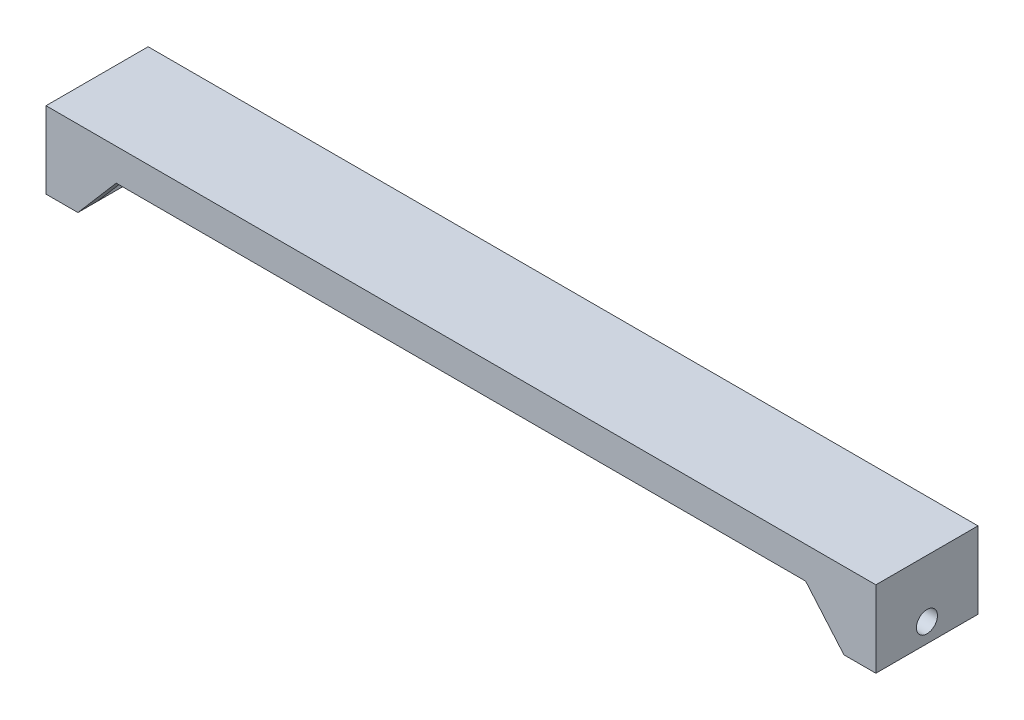
ISO-10303-21;
HEADER;
FILE_DESCRIPTION(('STEP AP214'),'2;1');
FILE_NAME('part.step','',(''),(''),'','','');
FILE_SCHEMA(('AUTOMOTIVE_DESIGN { 1 0 10303 214 1 1 1 1 }'));
ENDSEC;
DATA;
#1=APPLICATION_CONTEXT('core data for automotive mechanical design processes');
#2=APPLICATION_PROTOCOL_DEFINITION('international standard','automotive_design',2000,#1);
#3=PRODUCT_CONTEXT('',#1,'mechanical');
#4=PRODUCT('Part','Part','',(#3));
#5=PRODUCT_RELATED_PRODUCT_CATEGORY('part','',(#4));
#6=PRODUCT_DEFINITION_FORMATION('','',#4);
#7=PRODUCT_DEFINITION_CONTEXT('part definition',#1,'design');
#8=PRODUCT_DEFINITION('design','',#6,#7);
#9=PRODUCT_DEFINITION_SHAPE('','',#8);
#10=(LENGTH_UNIT() NAMED_UNIT(*) SI_UNIT(.MILLI.,.METRE.));
#11=(NAMED_UNIT(*) PLANE_ANGLE_UNIT() SI_UNIT($,.RADIAN.));
#12=(NAMED_UNIT(*) SI_UNIT($,.STERADIAN.) SOLID_ANGLE_UNIT());
#13=UNCERTAINTY_MEASURE_WITH_UNIT(LENGTH_MEASURE(1.E-05),#10,'distance_accuracy_value','');
#14=(GEOMETRIC_REPRESENTATION_CONTEXT(3) GLOBAL_UNCERTAINTY_ASSIGNED_CONTEXT((#13)) GLOBAL_UNIT_ASSIGNED_CONTEXT((#10,
#11,#12)) REPRESENTATION_CONTEXT('',''));
#15=CARTESIAN_POINT('',(0.,0.,0.));
#16=DIRECTION('',(0.,0.,1.));
#17=DIRECTION('',(1.,0.,0.));
#18=AXIS2_PLACEMENT_3D('',#15,#16,#17);
#19=CARTESIAN_POINT('',(60.,-5.00000000000001,16.));
#20=DIRECTION('',(0.,1.,0.));
#21=DIRECTION('',(0.,0.,1.));
#22=AXIS2_PLACEMENT_3D('',#19,#20,#21);
#23=PLANE('',#22);
#24=DIRECTION('',(-1.,0.,0.));
#25=VECTOR('',#24,1.);
#26=CARTESIAN_POINT('',(54.,-5.00000000000001,13.));
#27=LINE('',#26,#25);
#28=CARTESIAN_POINT('',(60.,-5.00000000000001,13.));
#29=VERTEX_POINT('',#28);
#30=CARTESIAN_POINT('',(54.,-5.00000000000001,13.));
#31=VERTEX_POINT('',#30);
#32=EDGE_CURVE('E154',#29,#31,#27,.T.);
#33=ORIENTED_EDGE('',*,*,#32,.T.);
#34=DIRECTION('',(0.,0.,1.));
#35=VECTOR('',#34,1.);
#36=CARTESIAN_POINT('',(54.,-5.00000000000001,13.));
#37=LINE('',#36,#35);
#38=CARTESIAN_POINT('',(54.,-5.00000000000001,16.));
#39=VERTEX_POINT('',#38);
#40=EDGE_CURVE('E139',#31,#39,#37,.T.);
#41=ORIENTED_EDGE('',*,*,#40,.T.);
#42=DIRECTION('',(1.,0.,0.));
#43=VECTOR('',#42,1.);
#44=CARTESIAN_POINT('',(60.,-5.00000000000001,16.));
#45=LINE('',#44,#43);
#46=CARTESIAN_POINT('',(-54.,-5.00000000000001,16.));
#47=VERTEX_POINT('',#46);
#48=EDGE_CURVE('E224',#47,#39,#45,.T.);
#49=ORIENTED_EDGE('',*,*,#48,.F.);
#50=DIRECTION('',(0.,0.,1.));
#51=VECTOR('',#50,1.);
#52=CARTESIAN_POINT('',(-54.,-5.00000000000001,13.));
#53=LINE('',#52,#51);
#54=CARTESIAN_POINT('',(-54.,-5.00000000000001,13.));
#55=VERTEX_POINT('',#54);
#56=EDGE_CURVE('E184',#55,#47,#53,.T.);
#57=ORIENTED_EDGE('',*,*,#56,.F.);
#58=DIRECTION('',(1.,0.,0.));
#59=VECTOR('',#58,1.);
#60=CARTESIAN_POINT('',(-54.,-5.00000000000001,13.));
#61=LINE('',#60,#59);
#62=CARTESIAN_POINT('',(-60.,-5.00000000000001,13.));
#63=VERTEX_POINT('',#62);
#64=EDGE_CURVE('E177',#63,#55,#61,.T.);
#65=ORIENTED_EDGE('',*,*,#64,.F.);
#66=DIRECTION('',(0.,0.,-1.));
#67=VECTOR('',#66,1.);
#68=CARTESIAN_POINT('',(-60.,-5.00000000000001,16.));
#69=LINE('',#68,#67);
#70=CARTESIAN_POINT('',(-60.,-5.00000000000001,3.));
#71=VERTEX_POINT('',#70);
#72=EDGE_CURVE('E257',#63,#71,#69,.T.);
#73=ORIENTED_EDGE('',*,*,#72,.T.);
#74=DIRECTION('',(1.,0.,0.));
#75=VECTOR('',#74,1.);
#76=CARTESIAN_POINT('',(-54.,-5.00000000000001,3.));
#77=LINE('',#76,#75);
#78=CARTESIAN_POINT('',(-54.,-5.00000000000001,3.));
#79=VERTEX_POINT('',#78);
#80=EDGE_CURVE('E189',#71,#79,#77,.T.);
#81=ORIENTED_EDGE('',*,*,#80,.T.);
#82=DIRECTION('',(0.,0.,-1.));
#83=VECTOR('',#82,1.);
#84=CARTESIAN_POINT('',(-54.,-5.00000000000001,3.));
#85=LINE('',#84,#83);
#86=CARTESIAN_POINT('',(-54.,-5.00000000000001,0.));
#87=VERTEX_POINT('',#86);
#88=EDGE_CURVE('E197',#79,#87,#85,.T.);
#89=ORIENTED_EDGE('',*,*,#88,.T.);
#90=DIRECTION('',(1.,0.,0.));
#91=VECTOR('',#90,1.);
#92=CARTESIAN_POINT('',(60.,-5.00000000000001,0.));
#93=LINE('',#92,#91);
#94=CARTESIAN_POINT('',(54.,-5.00000000000002,0.));
#95=VERTEX_POINT('',#94);
#96=EDGE_CURVE('E237',#87,#95,#93,.T.);
#97=ORIENTED_EDGE('',*,*,#96,.T.);
#98=DIRECTION('',(0.,0.,-1.));
#99=VECTOR('',#98,1.);
#100=CARTESIAN_POINT('',(54.,-5.00000000000001,3.));
#101=LINE('',#100,#99);
#102=CARTESIAN_POINT('',(54.,-5.00000000000001,3.));
#103=VERTEX_POINT('',#102);
#104=EDGE_CURVE('E52',#103,#95,#101,.T.);
#105=ORIENTED_EDGE('',*,*,#104,.F.);
#106=DIRECTION('',(-1.,0.,0.));
#107=VECTOR('',#106,1.);
#108=CARTESIAN_POINT('',(54.,-5.00000000000001,3.));
#109=LINE('',#108,#107);
#110=CARTESIAN_POINT('',(60.,-5.00000000000001,3.));
#111=VERTEX_POINT('',#110);
#112=EDGE_CURVE('E161',#111,#103,#109,.T.);
#113=ORIENTED_EDGE('',*,*,#112,.F.);
#114=DIRECTION('',(0.,0.,-1.));
#115=VECTOR('',#114,1.);
#116=CARTESIAN_POINT('',(60.,-5.00000000000001,16.));
#117=LINE('',#116,#115);
#118=EDGE_CURVE('E60',#29,#111,#117,.T.);
#119=ORIENTED_EDGE('',*,*,#118,.F.);
#120=EDGE_LOOP('',(#33,#41,#49,#57,#65,#73,#81,#89,#97,#105,#113,#119));
#121=FACE_BOUND('',#120,.T.);
#122=ADVANCED_FACE('F37',(#121),#23,.F.);
#123=CARTESIAN_POINT('',(-65.,-12.,16.));
#124=DIRECTION('',(1.,0.,0.));
#125=DIRECTION('',(0.,0.,-1.));
#126=AXIS2_PLACEMENT_3D('',#123,#124,#125);
#127=PLANE('',#126);
#128=CARTESIAN_POINT('',(-65.,-9.,8.));
#129=DIRECTION('',(1.,0.,0.));
#130=DIRECTION('',(0.,1.,0.));
#131=AXIS2_PLACEMENT_3D('',#128,#129,#130);
#132=CIRCLE('',#131,1.65);
#133=CARTESIAN_POINT('',(-65.,-7.35,8.));
#134=VERTEX_POINT('',#133);
#135=EDGE_CURVE('E207',#134,#134,#132,.T.);
#136=ORIENTED_EDGE('',*,*,#135,.T.);
#137=EDGE_LOOP('',(#136));
#138=FACE_BOUND('',#137,.T.);
#139=DIRECTION('',(0.,-1.,0.));
#140=VECTOR('',#139,1.);
#141=CARTESIAN_POINT('',(-65.,-12.,0.));
#142=LINE('',#141,#140);
#143=CARTESIAN_POINT('',(-65.,0.,0.));
#144=VERTEX_POINT('',#143);
#145=CARTESIAN_POINT('',(-65.,-12.,0.));
#146=VERTEX_POINT('',#145);
#147=EDGE_CURVE('E216',#144,#146,#142,.T.);
#148=ORIENTED_EDGE('',*,*,#147,.T.);
#149=DIRECTION('',(0.,0.,-1.));
#150=VECTOR('',#149,1.);
#151=CARTESIAN_POINT('',(-65.,-12.,16.));
#152=LINE('',#151,#150);
#153=CARTESIAN_POINT('',(-65.,-12.,16.));
#154=VERTEX_POINT('',#153);
#155=EDGE_CURVE('E11',#154,#146,#152,.T.);
#156=ORIENTED_EDGE('',*,*,#155,.F.);
#157=DIRECTION('',(0.,-1.,0.));
#158=VECTOR('',#157,1.);
#159=CARTESIAN_POINT('',(-65.,-12.,16.));
#160=LINE('',#159,#158);
#161=CARTESIAN_POINT('',(-65.,0.,16.));
#162=VERTEX_POINT('',#161);
#163=EDGE_CURVE('E217',#162,#154,#160,.T.);
#164=ORIENTED_EDGE('',*,*,#163,.F.);
#165=DIRECTION('',(0.,0.,-1.));
#166=VECTOR('',#165,1.);
#167=CARTESIAN_POINT('',(-65.,0.,16.));
#168=LINE('',#167,#166);
#169=EDGE_CURVE('E232',#162,#144,#168,.T.);
#170=ORIENTED_EDGE('',*,*,#169,.T.);
#171=EDGE_LOOP('',(#148,#156,#164,#170));
#172=FACE_BOUND('',#171,.T.);
#173=ADVANCED_FACE('F39',(#138,#172),#127,.F.);
#174=CARTESIAN_POINT('',(-60.,-12.,16.));
#175=DIRECTION('',(0.,1.,0.));
#176=DIRECTION('',(0.,0.,1.));
#177=AXIS2_PLACEMENT_3D('',#174,#175,#176);
#178=PLANE('',#177);
#179=DIRECTION('',(1.,0.,0.));
#180=VECTOR('',#179,1.);
#181=CARTESIAN_POINT('',(-60.,-12.,0.));
#182=LINE('',#181,#180);
#183=CARTESIAN_POINT('',(-60.,-12.,0.));
#184=VERTEX_POINT('',#183);
#185=EDGE_CURVE('E235',#146,#184,#182,.T.);
#186=ORIENTED_EDGE('',*,*,#185,.T.);
#187=DIRECTION('',(0.,0.,-1.));
#188=VECTOR('',#187,1.);
#189=CARTESIAN_POINT('',(-60.,-12.,3.));
#190=LINE('',#189,#188);
#191=CARTESIAN_POINT('',(-60.,-12.,3.));
#192=VERTEX_POINT('',#191);
#193=EDGE_CURVE('E200',#192,#184,#190,.T.);
#194=ORIENTED_EDGE('',*,*,#193,.F.);
#195=DIRECTION('',(0.,0.,-1.));
#196=VECTOR('',#195,1.);
#197=CARTESIAN_POINT('',(-60.,-12.,16.));
#198=LINE('',#197,#196);
#199=CARTESIAN_POINT('',(-60.,-12.,13.));
#200=VERTEX_POINT('',#199);
#201=EDGE_CURVE('E258',#200,#192,#198,.T.);
#202=ORIENTED_EDGE('',*,*,#201,.F.);
#203=CARTESIAN_POINT('',(-60.,-12.,16.));
#204=VERTEX_POINT('',#203);
#205=EDGE_CURVE('E45',#204,#200,#198,.T.);
#206=ORIENTED_EDGE('',*,*,#205,.F.);
#207=DIRECTION('',(1.,0.,0.));
#208=VECTOR('',#207,1.);
#209=CARTESIAN_POINT('',(-60.,-12.,16.));
#210=LINE('',#209,#208);
#211=EDGE_CURVE('E220',#154,#204,#210,.T.);
#212=ORIENTED_EDGE('',*,*,#211,.F.);
#213=ORIENTED_EDGE('',*,*,#155,.T.);
#214=EDGE_LOOP('',(#186,#194,#202,#206,#212,#213));
#215=FACE_BOUND('',#214,.T.);
#216=ADVANCED_FACE('F271',(#215),#178,.F.);
#217=CARTESIAN_POINT('',(-60.,-5.00000000000001,16.));
#218=DIRECTION('',(-1.,0.,0.));
#219=DIRECTION('',(0.,-1.,0.));
#220=AXIS2_PLACEMENT_3D('',#217,#218,#219);
#221=PLANE('',#220);
#222=CARTESIAN_POINT('',(-60.,-9.,8.));
#223=DIRECTION('',(-1.,0.,0.));
#224=DIRECTION('',(0.,-1.,0.));
#225=AXIS2_PLACEMENT_3D('',#222,#223,#224);
#226=CIRCLE('',#225,1.65);
#227=CARTESIAN_POINT('',(-60.,-10.65,8.));
#228=VERTEX_POINT('',#227);
#229=EDGE_CURVE('E213',#228,#228,#226,.T.);
#230=ORIENTED_EDGE('',*,*,#229,.T.);
#231=EDGE_LOOP('',(#230));
#232=FACE_BOUND('',#231,.T.);
#233=ORIENTED_EDGE('',*,*,#72,.F.);
#234=DIRECTION('',(0.,1.,0.));
#235=VECTOR('',#234,1.);
#236=CARTESIAN_POINT('',(-60.,-5.00000000000001,13.));
#237=LINE('',#236,#235);
#238=EDGE_CURVE('E180',#200,#63,#237,.T.);
#239=ORIENTED_EDGE('',*,*,#238,.F.);
#240=ORIENTED_EDGE('',*,*,#201,.T.);
#241=DIRECTION('',(0.,1.,0.));
#242=VECTOR('',#241,1.);
#243=CARTESIAN_POINT('',(-60.,-5.00000000000001,3.));
#244=LINE('',#243,#242);
#245=EDGE_CURVE('E194',#192,#71,#244,.T.);
#246=ORIENTED_EDGE('',*,*,#245,.T.);
#247=EDGE_LOOP('',(#233,#239,#240,#246));
#248=FACE_BOUND('',#247,.T.);
#249=ADVANCED_FACE('F267',(#232,#248),#221,.F.);
#250=CARTESIAN_POINT('',(60.,-12.,16.));
#251=DIRECTION('',(1.,0.,0.));
#252=DIRECTION('',(0.,1.,0.));
#253=AXIS2_PLACEMENT_3D('',#250,#251,#252);
#254=PLANE('',#253);
#255=CARTESIAN_POINT('',(60.,-9.00000000000007,8.));
#256=DIRECTION('',(1.,0.,0.));
#257=DIRECTION('',(0.,1.,0.));
#258=AXIS2_PLACEMENT_3D('',#255,#256,#257);
#259=CIRCLE('',#258,1.65);
#260=CARTESIAN_POINT('',(60.,-7.35000000000007,8.));
#261=VERTEX_POINT('',#260);
#262=EDGE_CURVE('E210',#261,#261,#259,.T.);
#263=ORIENTED_EDGE('',*,*,#262,.T.);
#264=EDGE_LOOP('',(#263));
#265=FACE_BOUND('',#264,.T.);
#266=DIRECTION('',(0.,0.,-1.));
#267=VECTOR('',#266,1.);
#268=CARTESIAN_POINT('',(60.,-12.,16.));
#269=LINE('',#268,#267);
#270=CARTESIAN_POINT('',(60.,-12.,13.));
#271=VERTEX_POINT('',#270);
#272=CARTESIAN_POINT('',(60.,-12.,3.));
#273=VERTEX_POINT('',#272);
#274=EDGE_CURVE('E252',#271,#273,#269,.T.);
#275=ORIENTED_EDGE('',*,*,#274,.F.);
#276=DIRECTION('',(0.,1.,0.));
#277=VECTOR('',#276,1.);
#278=CARTESIAN_POINT('',(60.,-5.00000000000001,13.));
#279=LINE('',#278,#277);
#280=EDGE_CURVE('E150',#271,#29,#279,.T.);
#281=ORIENTED_EDGE('',*,*,#280,.T.);
#282=ORIENTED_EDGE('',*,*,#118,.T.);
#283=DIRECTION('',(0.,1.,0.));
#284=VECTOR('',#283,1.);
#285=CARTESIAN_POINT('',(60.,-5.00000000000001,3.));
#286=LINE('',#285,#284);
#287=EDGE_CURVE('E164',#273,#111,#286,.T.);
#288=ORIENTED_EDGE('',*,*,#287,.F.);
#289=EDGE_LOOP('',(#275,#281,#282,#288));
#290=FACE_BOUND('',#289,.T.);
#291=ADVANCED_FACE('F302',(#265,#290),#254,.F.);
#292=CARTESIAN_POINT('',(65.,-12.,16.));
#293=DIRECTION('',(0.,1.,0.));
#294=DIRECTION('',(0.,0.,1.));
#295=AXIS2_PLACEMENT_3D('',#292,#293,#294);
#296=PLANE('',#295);
#297=DIRECTION('',(1.,0.,0.));
#298=VECTOR('',#297,1.);
#299=CARTESIAN_POINT('',(65.,-12.,0.));
#300=LINE('',#299,#298);
#301=CARTESIAN_POINT('',(60.,-12.,0.));
#302=VERTEX_POINT('',#301);
#303=CARTESIAN_POINT('',(65.,-12.,0.));
#304=VERTEX_POINT('',#303);
#305=EDGE_CURVE('E239',#302,#304,#300,.T.);
#306=ORIENTED_EDGE('',*,*,#305,.T.);
#307=DIRECTION('',(0.,0.,-1.));
#308=VECTOR('',#307,1.);
#309=CARTESIAN_POINT('',(65.,-12.,16.));
#310=LINE('',#309,#308);
#311=CARTESIAN_POINT('',(65.,-12.,16.));
#312=VERTEX_POINT('',#311);
#313=EDGE_CURVE('E249',#312,#304,#310,.T.);
#314=ORIENTED_EDGE('',*,*,#313,.F.);
#315=DIRECTION('',(1.,0.,0.));
#316=VECTOR('',#315,1.);
#317=CARTESIAN_POINT('',(65.,-12.,16.));
#318=LINE('',#317,#316);
#319=CARTESIAN_POINT('',(60.,-12.,16.));
#320=VERTEX_POINT('',#319);
#321=EDGE_CURVE('E226',#320,#312,#318,.T.);
#322=ORIENTED_EDGE('',*,*,#321,.F.);
#323=EDGE_CURVE('E253',#320,#271,#269,.T.);
#324=ORIENTED_EDGE('',*,*,#323,.T.);
#325=ORIENTED_EDGE('',*,*,#274,.T.);
#326=DIRECTION('',(0.,0.,-1.));
#327=VECTOR('',#326,1.);
#328=CARTESIAN_POINT('',(60.,-12.,3.));
#329=LINE('',#328,#327);
#330=EDGE_CURVE('E170',#273,#302,#329,.T.);
#331=ORIENTED_EDGE('',*,*,#330,.T.);
#332=EDGE_LOOP('',(#306,#314,#322,#324,#325,#331));
#333=FACE_BOUND('',#332,.T.);
#334=ADVANCED_FACE('F305',(#333),#296,.F.);
#335=CARTESIAN_POINT('',(65.,0.,16.));
#336=DIRECTION('',(-1.,0.,0.));
#337=DIRECTION('',(0.,0.,1.));
#338=AXIS2_PLACEMENT_3D('',#335,#336,#337);
#339=PLANE('',#338);
#340=CARTESIAN_POINT('',(65.,-9.00000000000007,8.));
#341=DIRECTION('',(1.,0.,0.));
#342=DIRECTION('',(0.,1.,0.));
#343=AXIS2_PLACEMENT_3D('',#340,#341,#342);
#344=CIRCLE('',#343,1.65);
#345=CARTESIAN_POINT('',(65.,-7.35000000000007,8.));
#346=VERTEX_POINT('',#345);
#347=EDGE_CURVE('E203',#346,#346,#344,.T.);
#348=ORIENTED_EDGE('',*,*,#347,.F.);
#349=EDGE_LOOP('',(#348));
#350=FACE_BOUND('',#349,.T.);
#351=DIRECTION('',(0.,1.,0.));
#352=VECTOR('',#351,1.);
#353=CARTESIAN_POINT('',(65.,0.,0.));
#354=LINE('',#353,#352);
#355=CARTESIAN_POINT('',(65.,0.,0.));
#356=VERTEX_POINT('',#355);
#357=EDGE_CURVE('E241',#304,#356,#354,.T.);
#358=ORIENTED_EDGE('',*,*,#357,.T.);
#359=DIRECTION('',(0.,0.,-1.));
#360=VECTOR('',#359,1.);
#361=CARTESIAN_POINT('',(65.,0.,16.));
#362=LINE('',#361,#360);
#363=CARTESIAN_POINT('',(65.,0.,16.));
#364=VERTEX_POINT('',#363);
#365=EDGE_CURVE('E246',#364,#356,#362,.T.);
#366=ORIENTED_EDGE('',*,*,#365,.F.);
#367=DIRECTION('',(0.,1.,0.));
#368=VECTOR('',#367,1.);
#369=CARTESIAN_POINT('',(65.,0.,16.));
#370=LINE('',#369,#368);
#371=EDGE_CURVE('E228',#312,#364,#370,.T.);
#372=ORIENTED_EDGE('',*,*,#371,.F.);
#373=ORIENTED_EDGE('',*,*,#313,.T.);
#374=EDGE_LOOP('',(#358,#366,#372,#373));
#375=FACE_BOUND('',#374,.T.);
#376=ADVANCED_FACE('F311',(#350,#375),#339,.F.);
#377=CARTESIAN_POINT('',(-65.,0.,16.));
#378=DIRECTION('',(0.,-1.,0.));
#379=DIRECTION('',(0.,0.,-1.));
#380=AXIS2_PLACEMENT_3D('',#377,#378,#379);
#381=PLANE('',#380);
#382=DIRECTION('',(-1.,0.,0.));
#383=VECTOR('',#382,1.);
#384=CARTESIAN_POINT('',(-65.,0.,0.));
#385=LINE('',#384,#383);
#386=EDGE_CURVE('E221',#356,#144,#385,.T.);
#387=ORIENTED_EDGE('',*,*,#386,.T.);
#388=ORIENTED_EDGE('',*,*,#169,.F.);
#389=DIRECTION('',(-1.,0.,0.));
#390=VECTOR('',#389,1.);
#391=CARTESIAN_POINT('',(-65.,0.,16.));
#392=LINE('',#391,#390);
#393=EDGE_CURVE('E230',#364,#162,#392,.T.);
#394=ORIENTED_EDGE('',*,*,#393,.F.);
#395=ORIENTED_EDGE('',*,*,#365,.T.);
#396=EDGE_LOOP('',(#387,#388,#394,#395));
#397=FACE_BOUND('',#396,.T.);
#398=ADVANCED_FACE('F313',(#397),#381,.F.);
#399=CARTESIAN_POINT('',(0.,0.,16.));
#400=DIRECTION('',(0.,0.,-1.));
#401=DIRECTION('',(-1.,0.,0.));
#402=AXIS2_PLACEMENT_3D('',#399,#400,#401);
#403=PLANE('',#402);
#404=ORIENTED_EDGE('',*,*,#48,.T.);
#405=DIRECTION('',(0.65079137345597,-0.759256602365296,0.));
#406=VECTOR('',#405,1.);
#407=CARTESIAN_POINT('',(54.,-5.00000000000001,16.));
#408=LINE('',#407,#406);
#409=EDGE_CURVE('E145',#39,#320,#408,.T.);
#410=ORIENTED_EDGE('',*,*,#409,.T.);
#411=ORIENTED_EDGE('',*,*,#321,.T.);
#412=ORIENTED_EDGE('',*,*,#371,.T.);
#413=ORIENTED_EDGE('',*,*,#393,.T.);
#414=ORIENTED_EDGE('',*,*,#163,.T.);
#415=ORIENTED_EDGE('',*,*,#211,.T.);
#416=DIRECTION('',(-0.65079137345597,-0.759256602365296,0.));
#417=VECTOR('',#416,1.);
#418=CARTESIAN_POINT('',(-54.,-5.00000000000001,16.));
#419=LINE('',#418,#417);
#420=EDGE_CURVE('E174',#47,#204,#419,.T.);
#421=ORIENTED_EDGE('',*,*,#420,.F.);
#422=EDGE_LOOP('',(#404,#410,#411,#412,#413,#414,#415,#421));
#423=FACE_BOUND('',#422,.T.);
#424=ADVANCED_FACE('F286',(#423),#403,.F.);
#425=CARTESIAN_POINT('',(0.,0.,0.));
#426=DIRECTION('',(0.,0.,-1.));
#427=DIRECTION('',(-1.,0.,0.));
#428=AXIS2_PLACEMENT_3D('',#425,#426,#427);
#429=PLANE('',#428);
#430=DIRECTION('',(0.65079137345597,-0.759256602365296,0.));
#431=VECTOR('',#430,1.);
#432=CARTESIAN_POINT('',(54.,-5.00000000000001,0.));
#433=LINE('',#432,#431);
#434=EDGE_CURVE('E149',#95,#302,#433,.T.);
#435=ORIENTED_EDGE('',*,*,#434,.F.);
#436=ORIENTED_EDGE('',*,*,#96,.F.);
#437=DIRECTION('',(-0.65079137345597,-0.759256602365296,0.));
#438=VECTOR('',#437,1.);
#439=CARTESIAN_POINT('',(-54.,-5.00000000000001,0.));
#440=LINE('',#439,#438);
#441=EDGE_CURVE('E188',#87,#184,#440,.T.);
#442=ORIENTED_EDGE('',*,*,#441,.T.);
#443=ORIENTED_EDGE('',*,*,#185,.F.);
#444=ORIENTED_EDGE('',*,*,#147,.F.);
#445=ORIENTED_EDGE('',*,*,#386,.F.);
#446=ORIENTED_EDGE('',*,*,#357,.F.);
#447=ORIENTED_EDGE('',*,*,#305,.F.);
#448=EDGE_LOOP('',(#435,#436,#442,#443,#444,#445,#446,#447));
#449=FACE_BOUND('',#448,.T.);
#450=ADVANCED_FACE('F295',(#449),#429,.T.);
#451=CARTESIAN_POINT('',(-65.,-9.,8.));
#452=DIRECTION('',(1.,0.,0.));
#453=DIRECTION('',(0.,1.,0.));
#454=AXIS2_PLACEMENT_3D('',#451,#452,#453);
#455=CYLINDRICAL_SURFACE('',#454,1.65);
#456=ORIENTED_EDGE('',*,*,#347,.T.);
#457=EDGE_LOOP('',(#456));
#458=FACE_BOUND('',#457,.T.);
#459=ORIENTED_EDGE('',*,*,#262,.F.);
#460=EDGE_LOOP('',(#459));
#461=FACE_BOUND('',#460,.T.);
#462=ADVANCED_FACE('F370',(#458,#461),#455,.F.);
#463=ORIENTED_EDGE('',*,*,#135,.F.);
#464=EDGE_LOOP('',(#463));
#465=FACE_BOUND('',#464,.T.);
#466=ORIENTED_EDGE('',*,*,#229,.F.);
#467=EDGE_LOOP('',(#466));
#468=FACE_BOUND('',#467,.T.);
#469=ADVANCED_FACE('F375',(#465,#468),#455,.F.);
#470=CARTESIAN_POINT('',(-54.,-5.00000000000001,3.));
#471=DIRECTION('',(0.759256602365296,-0.650791373455969,0.));
#472=DIRECTION('',(0.65079137345597,0.759256602365296,0.));
#473=AXIS2_PLACEMENT_3D('',#470,#471,#472);
#474=PLANE('',#473);
#475=ORIENTED_EDGE('',*,*,#441,.F.);
#476=ORIENTED_EDGE('',*,*,#88,.F.);
#477=DIRECTION('',(-0.65079137345597,-0.759256602365296,0.));
#478=VECTOR('',#477,1.);
#479=CARTESIAN_POINT('',(-54.,-5.00000000000001,3.));
#480=LINE('',#479,#478);
#481=EDGE_CURVE('E191',#79,#192,#480,.T.);
#482=ORIENTED_EDGE('',*,*,#481,.T.);
#483=ORIENTED_EDGE('',*,*,#193,.T.);
#484=EDGE_LOOP('',(#475,#476,#482,#483));
#485=FACE_BOUND('',#484,.T.);
#486=ADVANCED_FACE('F276',(#485),#474,.T.);
#487=CARTESIAN_POINT('',(0.,0.,3.));
#488=DIRECTION('',(0.,0.,1.));
#489=DIRECTION('',(1.,0.,0.));
#490=AXIS2_PLACEMENT_3D('',#487,#488,#489);
#491=PLANE('',#490);
#492=ORIENTED_EDGE('',*,*,#80,.F.);
#493=ORIENTED_EDGE('',*,*,#245,.F.);
#494=ORIENTED_EDGE('',*,*,#481,.F.);
#495=EDGE_LOOP('',(#492,#493,#494));
#496=FACE_BOUND('',#495,.T.);
#497=ADVANCED_FACE('F278',(#496),#491,.T.);
#498=CARTESIAN_POINT('',(-54.,-5.00000000000001,13.));
#499=DIRECTION('',(-0.759256602365296,0.650791373455969,0.));
#500=DIRECTION('',(-0.65079137345597,-0.759256602365296,0.));
#501=AXIS2_PLACEMENT_3D('',#498,#499,#500);
#502=PLANE('',#501);
#503=ORIENTED_EDGE('',*,*,#420,.T.);
#504=ORIENTED_EDGE('',*,*,#205,.T.);
#505=DIRECTION('',(-0.65079137345597,-0.759256602365296,0.));
#506=VECTOR('',#505,1.);
#507=CARTESIAN_POINT('',(-54.,-5.00000000000001,13.));
#508=LINE('',#507,#506);
#509=EDGE_CURVE('E182',#55,#200,#508,.T.);
#510=ORIENTED_EDGE('',*,*,#509,.F.);
#511=ORIENTED_EDGE('',*,*,#56,.T.);
#512=EDGE_LOOP('',(#503,#504,#510,#511));
#513=FACE_BOUND('',#512,.T.);
#514=ADVANCED_FACE('F284',(#513),#502,.F.);
#515=CARTESIAN_POINT('',(0.,0.,13.));
#516=DIRECTION('',(0.,0.,-1.));
#517=DIRECTION('',(1.,0.,0.));
#518=AXIS2_PLACEMENT_3D('',#515,#516,#517);
#519=PLANE('',#518);
#520=ORIENTED_EDGE('',*,*,#64,.T.);
#521=ORIENTED_EDGE('',*,*,#509,.T.);
#522=ORIENTED_EDGE('',*,*,#238,.T.);
#523=EDGE_LOOP('',(#520,#521,#522));
#524=FACE_BOUND('',#523,.T.);
#525=ADVANCED_FACE('F283',(#524),#519,.T.);
#526=CARTESIAN_POINT('',(54.,-5.00000000000001,3.));
#527=DIRECTION('',(0.759256602365296,0.650791373455969,0.));
#528=DIRECTION('',(-0.65079137345597,0.759256602365296,0.));
#529=AXIS2_PLACEMENT_3D('',#526,#527,#528);
#530=PLANE('',#529);
#531=ORIENTED_EDGE('',*,*,#434,.T.);
#532=ORIENTED_EDGE('',*,*,#330,.F.);
#533=DIRECTION('',(0.65079137345597,-0.759256602365296,0.));
#534=VECTOR('',#533,1.);
#535=CARTESIAN_POINT('',(54.,-5.00000000000001,3.));
#536=LINE('',#535,#534);
#537=EDGE_CURVE('E167',#103,#273,#536,.T.);
#538=ORIENTED_EDGE('',*,*,#537,.F.);
#539=ORIENTED_EDGE('',*,*,#104,.T.);
#540=EDGE_LOOP('',(#531,#532,#538,#539));
#541=FACE_BOUND('',#540,.T.);
#542=ADVANCED_FACE('F299',(#541),#530,.F.);
#543=CARTESIAN_POINT('',(0.,0.,3.));
#544=DIRECTION('',(0.,0.,1.));
#545=DIRECTION('',(-1.,0.,0.));
#546=AXIS2_PLACEMENT_3D('',#543,#544,#545);
#547=PLANE('',#546);
#548=ORIENTED_EDGE('',*,*,#112,.T.);
#549=ORIENTED_EDGE('',*,*,#537,.T.);
#550=ORIENTED_EDGE('',*,*,#287,.T.);
#551=EDGE_LOOP('',(#548,#549,#550));
#552=FACE_BOUND('',#551,.T.);
#553=ADVANCED_FACE('F301',(#552),#547,.T.);
#554=CARTESIAN_POINT('',(54.,-5.00000000000001,13.));
#555=DIRECTION('',(-0.759256602365296,-0.650791373455969,0.));
#556=DIRECTION('',(0.65079137345597,-0.759256602365296,0.));
#557=AXIS2_PLACEMENT_3D('',#554,#555,#556);
#558=PLANE('',#557);
#559=ORIENTED_EDGE('',*,*,#409,.F.);
#560=ORIENTED_EDGE('',*,*,#40,.F.);
#561=DIRECTION('',(0.65079137345597,-0.759256602365296,0.));
#562=VECTOR('',#561,1.);
#563=CARTESIAN_POINT('',(54.,-5.00000000000001,13.));
#564=LINE('',#563,#562);
#565=EDGE_CURVE('E143',#31,#271,#564,.T.);
#566=ORIENTED_EDGE('',*,*,#565,.T.);
#567=ORIENTED_EDGE('',*,*,#323,.F.);
#568=EDGE_LOOP('',(#559,#560,#566,#567));
#569=FACE_BOUND('',#568,.T.);
#570=ADVANCED_FACE('F141',(#569),#558,.T.);
#571=CARTESIAN_POINT('',(0.,0.,13.));
#572=DIRECTION('',(0.,0.,-1.));
#573=DIRECTION('',(-1.,0.,0.));
#574=AXIS2_PLACEMENT_3D('',#571,#572,#573);
#575=PLANE('',#574);
#576=ORIENTED_EDGE('',*,*,#32,.F.);
#577=ORIENTED_EDGE('',*,*,#280,.F.);
#578=ORIENTED_EDGE('',*,*,#565,.F.);
#579=EDGE_LOOP('',(#576,#577,#578));
#580=FACE_BOUND('',#579,.T.);
#581=ADVANCED_FACE('F153',(#580),#575,.T.);
#582=CLOSED_SHELL('',(#122,#173,#216,#249,#291,#334,#376,#398,#424,#450,#462,#469,#486,#497,
#514,#525,#542,#553,#570,#581));
#583=MANIFOLD_SOLID_BREP('B2',#582);
#584=ADVANCED_BREP_SHAPE_REPRESENTATION('',(#18,#583),#14);
#585=SHAPE_DEFINITION_REPRESENTATION(#9,#584);
ENDSEC;
END-ISO-10303-21;
